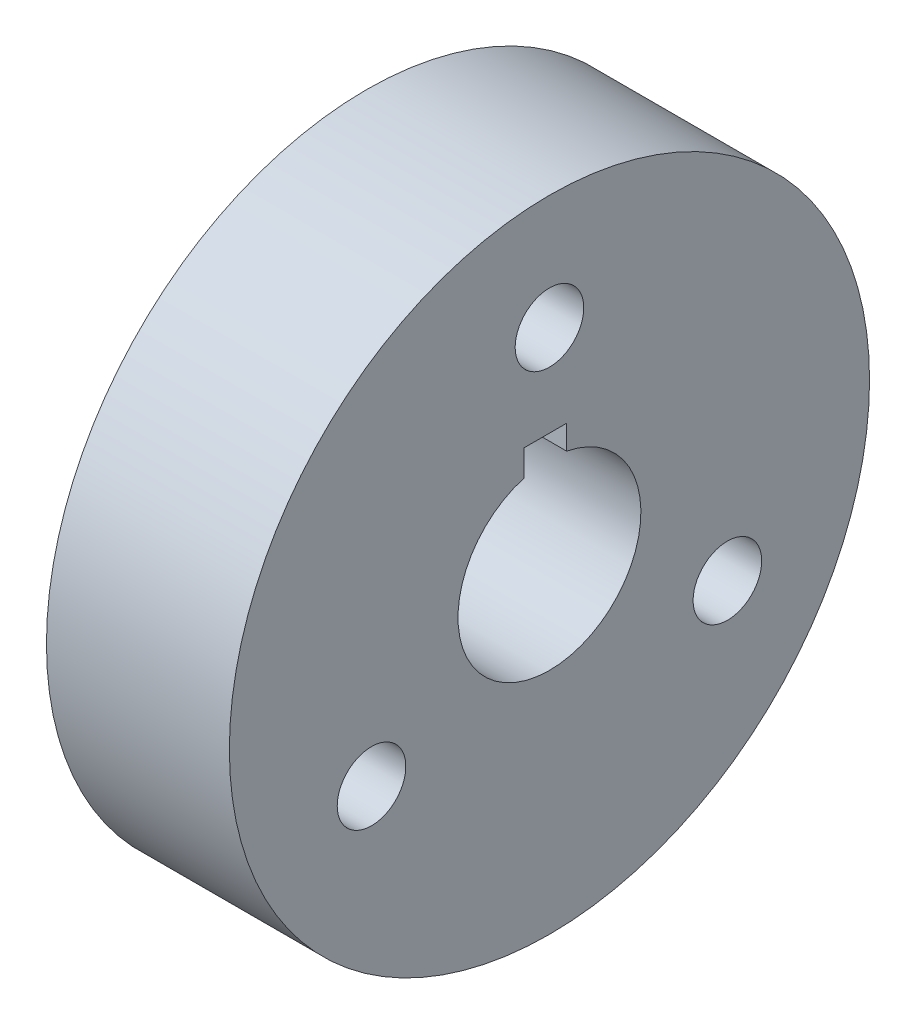
ISO-10303-21;
HEADER;
FILE_DESCRIPTION(('STEP AP214'),'2;1');
FILE_NAME('part.step','',(''),(''),'','','');
FILE_SCHEMA(('AUTOMOTIVE_DESIGN { 1 0 10303 214 1 1 1 1 }'));
ENDSEC;
DATA;
#1=APPLICATION_CONTEXT('core data for automotive mechanical design processes');
#2=APPLICATION_PROTOCOL_DEFINITION('international standard','automotive_design',2000,#1);
#3=PRODUCT_CONTEXT('',#1,'mechanical');
#4=PRODUCT('Part','Part','',(#3));
#5=PRODUCT_RELATED_PRODUCT_CATEGORY('part','',(#4));
#6=PRODUCT_DEFINITION_FORMATION('','',#4);
#7=PRODUCT_DEFINITION_CONTEXT('part definition',#1,'design');
#8=PRODUCT_DEFINITION('design','',#6,#7);
#9=PRODUCT_DEFINITION_SHAPE('','',#8);
#10=(LENGTH_UNIT() NAMED_UNIT(*) SI_UNIT(.MILLI.,.METRE.));
#11=(NAMED_UNIT(*) PLANE_ANGLE_UNIT() SI_UNIT($,.RADIAN.));
#12=(NAMED_UNIT(*) SI_UNIT($,.STERADIAN.) SOLID_ANGLE_UNIT());
#13=UNCERTAINTY_MEASURE_WITH_UNIT(LENGTH_MEASURE(1.E-05),#10,'distance_accuracy_value','');
#14=(GEOMETRIC_REPRESENTATION_CONTEXT(3) GLOBAL_UNCERTAINTY_ASSIGNED_CONTEXT((#13)) GLOBAL_UNIT_ASSIGNED_CONTEXT((#10,
#11,#12)) REPRESENTATION_CONTEXT('',''));
#15=CARTESIAN_POINT('',(0.,0.,0.));
#16=DIRECTION('',(0.,0.,1.));
#17=DIRECTION('',(1.,0.,0.));
#18=AXIS2_PLACEMENT_3D('',#15,#16,#17);
#19=CARTESIAN_POINT('',(-22.5232523252325,-16.5775401069519,0.));
#20=DIRECTION('',(-1.,0.,0.));
#21=DIRECTION('',(0.,0.,1.));
#22=AXIS2_PLACEMENT_3D('',#19,#20,#21);
#23=CYLINDRICAL_SURFACE('',#22,30.);
#24=CARTESIAN_POINT('',(-22.5232523252325,-16.5775401069519,0.));
#25=DIRECTION('',(-1.,0.,0.));
#26=DIRECTION('',(0.,0.,1.));
#27=AXIS2_PLACEMENT_3D('',#24,#25,#26);
#28=CIRCLE('',#27,30.);
#29=CARTESIAN_POINT('',(-22.5232523252325,-16.5775401069519,30.));
#30=VERTEX_POINT('',#29);
#31=EDGE_CURVE('E11',#30,#30,#28,.T.);
#32=ORIENTED_EDGE('',*,*,#31,.F.);
#33=EDGE_LOOP('',(#32));
#34=FACE_BOUND('',#33,.T.);
#35=CARTESIAN_POINT('',(17.4767476747675,-16.5775401069519,0.));
#36=DIRECTION('',(-1.,0.,0.));
#37=DIRECTION('',(0.,0.,1.));
#38=AXIS2_PLACEMENT_3D('',#35,#36,#37);
#39=CIRCLE('',#38,30.);
#40=CARTESIAN_POINT('',(17.4767476747675,-16.5775401069519,30.));
#41=VERTEX_POINT('',#40);
#42=EDGE_CURVE('E110',#41,#41,#39,.T.);
#43=ORIENTED_EDGE('',*,*,#42,.T.);
#44=EDGE_LOOP('',(#43));
#45=FACE_BOUND('',#44,.T.);
#46=ADVANCED_FACE('F33',(#34,#45),#23,.T.);
#47=CARTESIAN_POINT('',(-22.5232523252325,13.4224598930481,0.));
#48=DIRECTION('',(1.,0.,0.));
#49=DIRECTION('',(0.,0.,-1.));
#50=AXIS2_PLACEMENT_3D('',#47,#48,#49);
#51=PLANE('',#50);
#52=DIRECTION('',(0.,1.,0.));
#53=VECTOR('',#52,1.);
#54=CARTESIAN_POINT('',(-22.5232523252325,8.35439752463422,5.57559260171875));
#55=LINE('',#54,#53);
#56=CARTESIAN_POINT('',(-22.5232523252325,2.62956189047761,5.57559260171875));
#57=VERTEX_POINT('',#56);
#58=CARTESIAN_POINT('',(-22.5232523252325,8.35439752463422,5.57559260171875));
#59=VERTEX_POINT('',#58);
#60=EDGE_CURVE('E103',#57,#59,#55,.T.);
#61=ORIENTED_EDGE('',*,*,#60,.F.);
#62=CARTESIAN_POINT('',(-22.5232523252325,-16.5775401069519,0.));
#63=DIRECTION('',(-1.,0.,0.));
#64=DIRECTION('',(0.,0.,1.));
#65=AXIS2_PLACEMENT_3D('',#62,#63,#64);
#66=CIRCLE('',#65,20.);
#67=CARTESIAN_POINT('',(-22.5232523252325,3.06523406989498,-3.76316657050934));
#68=VERTEX_POINT('',#67);
#69=EDGE_CURVE('E47',#68,#57,#66,.T.);
#70=ORIENTED_EDGE('',*,*,#69,.F.);
#71=DIRECTION('',(0.,-1.,0.));
#72=VECTOR('',#71,1.);
#73=CARTESIAN_POINT('',(-22.5232523252325,3.06523406989498,-3.76316657050934));
#74=LINE('',#73,#72);
#75=CARTESIAN_POINT('',(-22.5232523252325,8.35439752463422,-3.76316657050934));
#76=VERTEX_POINT('',#75);
#77=EDGE_CURVE('E91',#76,#68,#74,.T.);
#78=ORIENTED_EDGE('',*,*,#77,.F.);
#79=DIRECTION('',(0.,0.,-1.));
#80=VECTOR('',#79,1.);
#81=CARTESIAN_POINT('',(-22.5232523252325,8.35439752463422,-3.76316657050934));
#82=LINE('',#81,#80);
#83=EDGE_CURVE('E94',#59,#76,#82,.T.);
#84=ORIENTED_EDGE('',*,*,#83,.F.);
#85=EDGE_LOOP('',(#61,#70,#78,#84));
#86=FACE_BOUND('',#85,.T.);
#87=ORIENTED_EDGE('',*,*,#31,.T.);
#88=EDGE_LOOP('',(#87));
#89=FACE_BOUND('',#88,.T.);
#90=ADVANCED_FACE('F129',(#86,#89),#51,.F.);
#91=CARTESIAN_POINT('',(37.4767476747675,-16.5775401069519,0.));
#92=DIRECTION('',(-1.,0.,0.));
#93=DIRECTION('',(0.,0.,1.));
#94=AXIS2_PLACEMENT_3D('',#91,#92,#93);
#95=PLANE('',#94);
#96=CARTESIAN_POINT('',(37.4767476747675,-39.0435089227451,-38.9121994302115));
#97=DIRECTION('',(-1.,0.,0.));
#98=DIRECTION('',(0.,0.866025403784436,-0.500000000000004));
#99=AXIS2_PLACEMENT_3D('',#96,#97,#98);
#100=CIRCLE('',#99,7.5);
#101=CARTESIAN_POINT('',(37.4767476747675,-32.5483183943618,-42.6621994302115));
#102=VERTEX_POINT('',#101);
#103=EDGE_CURVE('E196',#102,#102,#100,.T.);
#104=ORIENTED_EDGE('',*,*,#103,.T.);
#105=EDGE_LOOP('',(#104));
#106=FACE_BOUND('',#105,.T.);
#107=CARTESIAN_POINT('',(37.4767476747675,-39.0435089227445,38.9121994302118));
#108=DIRECTION('',(-1.,0.,0.));
#109=DIRECTION('',(0.,-0.866025403784443,-0.499999999999992));
#110=AXIS2_PLACEMENT_3D('',#107,#108,#109);
#111=CIRCLE('',#110,7.5);
#112=CARTESIAN_POINT('',(37.4767476747675,-45.5386994511279,35.1621994302118));
#113=VERTEX_POINT('',#112);
#114=EDGE_CURVE('E200',#113,#113,#111,.T.);
#115=ORIENTED_EDGE('',*,*,#114,.T.);
#116=EDGE_LOOP('',(#115));
#117=FACE_BOUND('',#116,.T.);
#118=CARTESIAN_POINT('',(37.4767476747675,28.3543975246342,0.));
#119=DIRECTION('',(-1.,0.,0.));
#120=DIRECTION('',(0.,0.,1.));
#121=AXIS2_PLACEMENT_3D('',#118,#119,#120);
#122=CIRCLE('',#121,7.5);
#123=CARTESIAN_POINT('',(37.4767476747675,28.3543975246342,7.5));
#124=VERTEX_POINT('',#123);
#125=EDGE_CURVE('E104',#124,#124,#122,.T.);
#126=ORIENTED_EDGE('',*,*,#125,.T.);
#127=EDGE_LOOP('',(#126));
#128=FACE_BOUND('',#127,.T.);
#129=DIRECTION('',(0.,-1.,0.));
#130=VECTOR('',#129,1.);
#131=CARTESIAN_POINT('',(37.4767476747675,3.06523406989498,-3.76316657050934));
#132=LINE('',#131,#130);
#133=CARTESIAN_POINT('',(37.4767476747675,8.35439752463422,-3.76316657050934));
#134=VERTEX_POINT('',#133);
#135=CARTESIAN_POINT('',(37.4767476747675,3.06523406989498,-3.76316657050934));
#136=VERTEX_POINT('',#135);
#137=EDGE_CURVE('E81',#134,#136,#132,.T.);
#138=ORIENTED_EDGE('',*,*,#137,.T.);
#139=CARTESIAN_POINT('',(37.4767476747675,-16.5775401069519,0.));
#140=DIRECTION('',(-1.,0.,0.));
#141=DIRECTION('',(0.,0.,1.));
#142=AXIS2_PLACEMENT_3D('',#139,#140,#141);
#143=CIRCLE('',#142,20.);
#144=CARTESIAN_POINT('',(37.4767476747675,2.62956189047761,5.57559260171875));
#145=VERTEX_POINT('',#144);
#146=EDGE_CURVE('E75',#136,#145,#143,.T.);
#147=ORIENTED_EDGE('',*,*,#146,.T.);
#148=DIRECTION('',(0.,1.,0.));
#149=VECTOR('',#148,1.);
#150=CARTESIAN_POINT('',(37.4767476747675,8.35439752463422,5.57559260171875));
#151=LINE('',#150,#149);
#152=CARTESIAN_POINT('',(37.4767476747675,8.35439752463421,5.57559260171875));
#153=VERTEX_POINT('',#152);
#154=EDGE_CURVE('E84',#145,#153,#151,.T.);
#155=ORIENTED_EDGE('',*,*,#154,.T.);
#156=DIRECTION('',(0.,0.,-1.));
#157=VECTOR('',#156,1.);
#158=CARTESIAN_POINT('',(37.4767476747675,8.35439752463422,-3.76316657050934));
#159=LINE('',#158,#157);
#160=EDGE_CURVE('E55',#153,#134,#159,.T.);
#161=ORIENTED_EDGE('',*,*,#160,.T.);
#162=EDGE_LOOP('',(#138,#147,#155,#161));
#163=FACE_BOUND('',#162,.T.);
#164=CARTESIAN_POINT('',(37.4767476747675,-16.5775401069519,0.));
#165=DIRECTION('',(-1.,0.,0.));
#166=DIRECTION('',(0.,0.,1.));
#167=AXIS2_PLACEMENT_3D('',#164,#165,#166);
#168=CIRCLE('',#167,70.);
#169=CARTESIAN_POINT('',(37.4767476747675,-16.5775401069519,70.));
#170=VERTEX_POINT('',#169);
#171=EDGE_CURVE('E40',#170,#170,#168,.T.);
#172=ORIENTED_EDGE('',*,*,#171,.F.);
#173=EDGE_LOOP('',(#172));
#174=FACE_BOUND('',#173,.T.);
#175=ADVANCED_FACE('F88',(#106,#117,#128,#163,#174),#95,.F.);
#176=CARTESIAN_POINT('',(-22.5232523252325,-16.5775401069519,0.));
#177=DIRECTION('',(-1.,0.,0.));
#178=DIRECTION('',(0.,0.,1.));
#179=AXIS2_PLACEMENT_3D('',#176,#177,#178);
#180=CYLINDRICAL_SURFACE('',#179,70.);
#181=CARTESIAN_POINT('',(-2.52325232523253,-16.5775401069519,0.));
#182=DIRECTION('',(-1.,0.,0.));
#183=DIRECTION('',(0.,0.,1.));
#184=AXIS2_PLACEMENT_3D('',#181,#182,#183);
#185=CIRCLE('',#184,70.);
#186=CARTESIAN_POINT('',(-2.52325232523253,-16.5775401069519,70.));
#187=VERTEX_POINT('',#186);
#188=EDGE_CURVE('E122',#187,#187,#185,.T.);
#189=ORIENTED_EDGE('',*,*,#188,.F.);
#190=EDGE_LOOP('',(#189));
#191=FACE_BOUND('',#190,.T.);
#192=ORIENTED_EDGE('',*,*,#171,.T.);
#193=EDGE_LOOP('',(#192));
#194=FACE_BOUND('',#193,.T.);
#195=ADVANCED_FACE('F127',(#191,#194),#180,.T.);
#196=CARTESIAN_POINT('',(-2.52325232523253,53.4224598930481,0.));
#197=DIRECTION('',(1.,0.,0.));
#198=DIRECTION('',(0.,0.,-1.));
#199=AXIS2_PLACEMENT_3D('',#196,#197,#198);
#200=PLANE('',#199);
#201=CARTESIAN_POINT('',(-2.52325232523253,-16.5775401069519,0.));
#202=DIRECTION('',(-1.,0.,0.));
#203=DIRECTION('',(0.,0.,1.));
#204=AXIS2_PLACEMENT_3D('',#201,#202,#203);
#205=CIRCLE('',#204,60.);
#206=CARTESIAN_POINT('',(-2.52325232523253,-16.5775401069519,60.));
#207=VERTEX_POINT('',#206);
#208=EDGE_CURVE('E119',#207,#207,#205,.T.);
#209=ORIENTED_EDGE('',*,*,#208,.F.);
#210=EDGE_LOOP('',(#209));
#211=FACE_BOUND('',#210,.T.);
#212=ORIENTED_EDGE('',*,*,#188,.T.);
#213=EDGE_LOOP('',(#212));
#214=FACE_BOUND('',#213,.T.);
#215=ADVANCED_FACE('F136',(#211,#214),#200,.F.);
#216=CARTESIAN_POINT('',(-22.5232523252325,-16.5775401069519,0.));
#217=DIRECTION('',(-1.,0.,0.));
#218=DIRECTION('',(0.,0.,1.));
#219=AXIS2_PLACEMENT_3D('',#216,#217,#218);
#220=CYLINDRICAL_SURFACE('',#219,60.);
#221=CARTESIAN_POINT('',(17.4767476747675,-16.5775401069519,0.));
#222=DIRECTION('',(-1.,0.,0.));
#223=DIRECTION('',(0.,0.,1.));
#224=AXIS2_PLACEMENT_3D('',#221,#222,#223);
#225=CIRCLE('',#224,60.);
#226=CARTESIAN_POINT('',(17.4767476747675,-16.5775401069519,60.));
#227=VERTEX_POINT('',#226);
#228=EDGE_CURVE('E116',#227,#227,#225,.T.);
#229=ORIENTED_EDGE('',*,*,#228,.F.);
#230=EDGE_LOOP('',(#229));
#231=FACE_BOUND('',#230,.T.);
#232=ORIENTED_EDGE('',*,*,#208,.T.);
#233=EDGE_LOOP('',(#232));
#234=FACE_BOUND('',#233,.T.);
#235=ADVANCED_FACE('F153',(#231,#234),#220,.F.);
#236=CARTESIAN_POINT('',(17.4767476747675,43.4224598930481,0.));
#237=DIRECTION('',(1.,0.,0.));
#238=DIRECTION('',(0.,0.,-1.));
#239=AXIS2_PLACEMENT_3D('',#236,#237,#238);
#240=PLANE('',#239);
#241=CARTESIAN_POINT('',(17.4767476747675,-39.0435089227451,-38.9121994302115));
#242=DIRECTION('',(-1.,0.,0.));
#243=DIRECTION('',(0.,0.866025403784436,-0.500000000000004));
#244=AXIS2_PLACEMENT_3D('',#241,#242,#243);
#245=CIRCLE('',#244,7.5);
#246=CARTESIAN_POINT('',(17.4767476747675,-32.5483183943618,-42.6621994302115));
#247=VERTEX_POINT('',#246);
#248=EDGE_CURVE('E199',#247,#247,#245,.T.);
#249=ORIENTED_EDGE('',*,*,#248,.F.);
#250=EDGE_LOOP('',(#249));
#251=FACE_BOUND('',#250,.T.);
#252=CARTESIAN_POINT('',(17.4767476747675,-39.0435089227445,38.9121994302118));
#253=DIRECTION('',(-1.,0.,0.));
#254=DIRECTION('',(0.,-0.866025403784443,-0.499999999999992));
#255=AXIS2_PLACEMENT_3D('',#252,#253,#254);
#256=CIRCLE('',#255,7.5);
#257=CARTESIAN_POINT('',(17.4767476747675,-45.5386994511279,35.1621994302118));
#258=VERTEX_POINT('',#257);
#259=EDGE_CURVE('E204',#258,#258,#256,.T.);
#260=ORIENTED_EDGE('',*,*,#259,.F.);
#261=EDGE_LOOP('',(#260));
#262=FACE_BOUND('',#261,.T.);
#263=CARTESIAN_POINT('',(17.4767476747675,28.3543975246342,0.));
#264=DIRECTION('',(-1.,0.,0.));
#265=DIRECTION('',(0.,0.,1.));
#266=AXIS2_PLACEMENT_3D('',#263,#264,#265);
#267=CIRCLE('',#266,7.5);
#268=CARTESIAN_POINT('',(17.4767476747675,28.3543975246342,7.5));
#269=VERTEX_POINT('',#268);
#270=EDGE_CURVE('E97',#269,#269,#267,.T.);
#271=ORIENTED_EDGE('',*,*,#270,.F.);
#272=EDGE_LOOP('',(#271));
#273=FACE_BOUND('',#272,.T.);
#274=ORIENTED_EDGE('',*,*,#42,.F.);
#275=EDGE_LOOP('',(#274));
#276=FACE_BOUND('',#275,.T.);
#277=ORIENTED_EDGE('',*,*,#228,.T.);
#278=EDGE_LOOP('',(#277));
#279=FACE_BOUND('',#278,.T.);
#280=ADVANCED_FACE('F150',(#251,#262,#273,#276,#279),#240,.F.);
#281=CARTESIAN_POINT('',(37.4767476747675,-16.5775401069519,0.));
#282=DIRECTION('',(-1.,0.,0.));
#283=DIRECTION('',(0.,0.,1.));
#284=AXIS2_PLACEMENT_3D('',#281,#282,#283);
#285=CYLINDRICAL_SURFACE('',#284,20.);
#286=ORIENTED_EDGE('',*,*,#69,.T.);
#287=DIRECTION('',(-1.,0.,0.));
#288=VECTOR('',#287,1.);
#289=CARTESIAN_POINT('',(37.4767476747675,2.62956189047761,5.57559260171875));
#290=LINE('',#289,#288);
#291=EDGE_CURVE('E71',#145,#57,#290,.T.);
#292=ORIENTED_EDGE('',*,*,#291,.F.);
#293=ORIENTED_EDGE('',*,*,#146,.F.);
#294=DIRECTION('',(-1.,0.,0.));
#295=VECTOR('',#294,1.);
#296=CARTESIAN_POINT('',(37.4767476747675,3.06523406989498,-3.76316657050934));
#297=LINE('',#296,#295);
#298=EDGE_CURVE('E108',#136,#68,#297,.T.);
#299=ORIENTED_EDGE('',*,*,#298,.T.);
#300=EDGE_LOOP('',(#286,#292,#293,#299));
#301=FACE_BOUND('',#300,.T.);
#302=ADVANCED_FACE('F73',(#301),#285,.F.);
#303=CARTESIAN_POINT('',(37.4767476747675,3.06523406989498,-3.76316657050934));
#304=DIRECTION('',(0.,0.,-1.));
#305=DIRECTION('',(-1.,0.,0.));
#306=AXIS2_PLACEMENT_3D('',#303,#304,#305);
#307=PLANE('',#306);
#308=ORIENTED_EDGE('',*,*,#77,.T.);
#309=ORIENTED_EDGE('',*,*,#298,.F.);
#310=ORIENTED_EDGE('',*,*,#137,.F.);
#311=DIRECTION('',(-1.,0.,0.));
#312=VECTOR('',#311,1.);
#313=CARTESIAN_POINT('',(37.4767476747675,8.35439752463422,-3.76316657050934));
#314=LINE('',#313,#312);
#315=EDGE_CURVE('E111',#134,#76,#314,.T.);
#316=ORIENTED_EDGE('',*,*,#315,.T.);
#317=EDGE_LOOP('',(#308,#309,#310,#316));
#318=FACE_BOUND('',#317,.T.);
#319=ADVANCED_FACE('F172',(#318),#307,.F.);
#320=CARTESIAN_POINT('',(37.4767476747675,8.35439752463422,-3.76316657050934));
#321=DIRECTION('',(0.,1.,0.));
#322=DIRECTION('',(0.,0.,1.));
#323=AXIS2_PLACEMENT_3D('',#320,#321,#322);
#324=PLANE('',#323);
#325=ORIENTED_EDGE('',*,*,#83,.T.);
#326=ORIENTED_EDGE('',*,*,#315,.F.);
#327=ORIENTED_EDGE('',*,*,#160,.F.);
#328=DIRECTION('',(-1.,0.,0.));
#329=VECTOR('',#328,1.);
#330=CARTESIAN_POINT('',(37.4767476747675,8.35439752463422,5.57559260171875));
#331=LINE('',#330,#329);
#332=EDGE_CURVE('E80',#153,#59,#331,.T.);
#333=ORIENTED_EDGE('',*,*,#332,.T.);
#334=EDGE_LOOP('',(#325,#326,#327,#333));
#335=FACE_BOUND('',#334,.T.);
#336=ADVANCED_FACE('F176',(#335),#324,.F.);
#337=CARTESIAN_POINT('',(37.4767476747675,8.35439752463422,5.57559260171875));
#338=DIRECTION('',(0.,0.,1.));
#339=DIRECTION('',(1.,0.,0.));
#340=AXIS2_PLACEMENT_3D('',#337,#338,#339);
#341=PLANE('',#340);
#342=ORIENTED_EDGE('',*,*,#60,.T.);
#343=ORIENTED_EDGE('',*,*,#332,.F.);
#344=ORIENTED_EDGE('',*,*,#154,.F.);
#345=ORIENTED_EDGE('',*,*,#291,.T.);
#346=EDGE_LOOP('',(#342,#343,#344,#345));
#347=FACE_BOUND('',#346,.T.);
#348=ADVANCED_FACE('F85',(#347),#341,.F.);
#349=CARTESIAN_POINT('',(37.4767476747675,28.3543975246342,0.));
#350=DIRECTION('',(-1.,0.,0.));
#351=DIRECTION('',(0.,0.,1.));
#352=AXIS2_PLACEMENT_3D('',#349,#350,#351);
#353=CYLINDRICAL_SURFACE('',#352,7.5);
#354=ORIENTED_EDGE('',*,*,#125,.F.);
#355=EDGE_LOOP('',(#354));
#356=FACE_BOUND('',#355,.T.);
#357=ORIENTED_EDGE('',*,*,#270,.T.);
#358=EDGE_LOOP('',(#357));
#359=FACE_BOUND('',#358,.T.);
#360=ADVANCED_FACE('F175',(#356,#359),#353,.F.);
#361=CARTESIAN_POINT('',(37.4767476747675,-39.0435089227445,38.9121994302118));
#362=DIRECTION('',(-1.,0.,0.));
#363=DIRECTION('',(0.,0.,1.));
#364=AXIS2_PLACEMENT_3D('',#361,#362,#363);
#365=CYLINDRICAL_SURFACE('',#364,7.5);
#366=ORIENTED_EDGE('',*,*,#114,.F.);
#367=EDGE_LOOP('',(#366));
#368=FACE_BOUND('',#367,.T.);
#369=ORIENTED_EDGE('',*,*,#259,.T.);
#370=EDGE_LOOP('',(#369));
#371=FACE_BOUND('',#370,.T.);
#372=ADVANCED_FACE('F184',(#368,#371),#365,.F.);
#373=CARTESIAN_POINT('',(37.4767476747675,-39.0435089227451,-38.9121994302115));
#374=DIRECTION('',(-1.,0.,0.));
#375=DIRECTION('',(0.,0.,1.));
#376=AXIS2_PLACEMENT_3D('',#373,#374,#375);
#377=CYLINDRICAL_SURFACE('',#376,7.5);
#378=ORIENTED_EDGE('',*,*,#103,.F.);
#379=EDGE_LOOP('',(#378));
#380=FACE_BOUND('',#379,.T.);
#381=ORIENTED_EDGE('',*,*,#248,.T.);
#382=EDGE_LOOP('',(#381));
#383=FACE_BOUND('',#382,.T.);
#384=ADVANCED_FACE('F188',(#380,#383),#377,.F.);
#385=CLOSED_SHELL('',(#46,#90,#175,#195,#215,#235,#280,#302,#319,#336,#348,#360,#372,#384));
#386=MANIFOLD_SOLID_BREP('B2',#385);
#387=ADVANCED_BREP_SHAPE_REPRESENTATION('',(#18,#386),#14);
#388=SHAPE_DEFINITION_REPRESENTATION(#9,#387);
ENDSEC;
END-ISO-10303-21;
